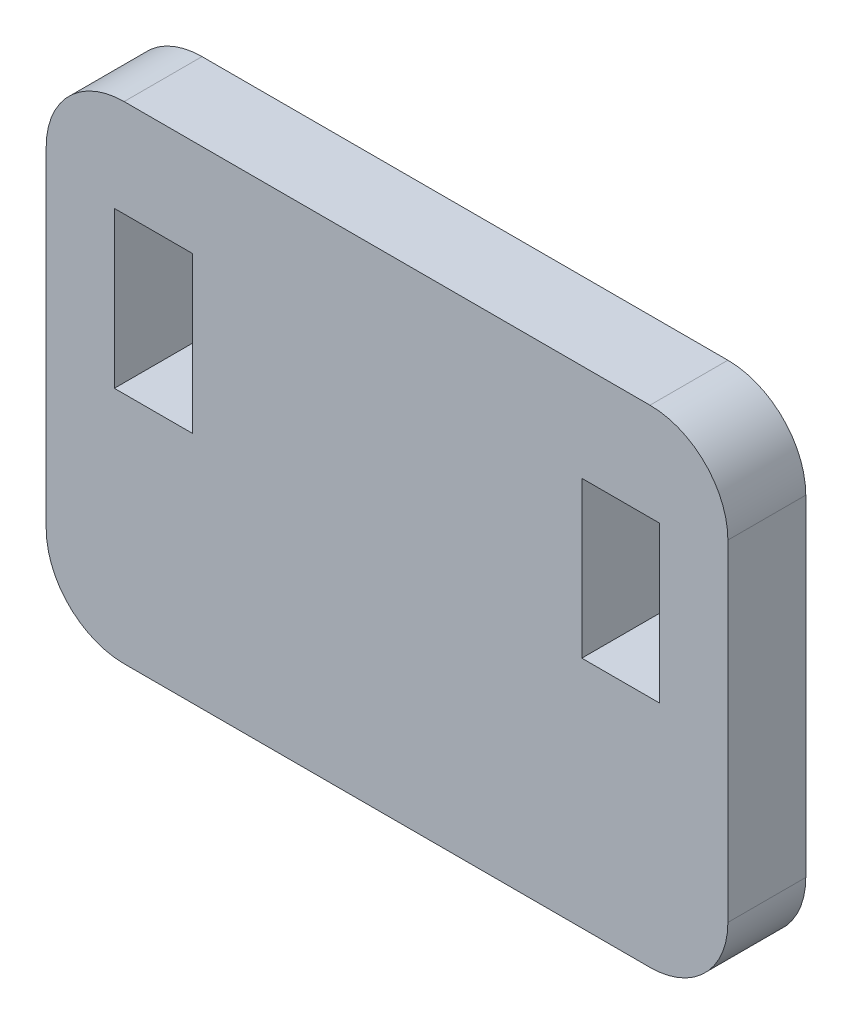
ISO-10303-21;
HEADER;
FILE_DESCRIPTION(('STEP AP214'),'2;1');
FILE_NAME('part.step','',(''),(''),'','','');
FILE_SCHEMA(('AUTOMOTIVE_DESIGN { 1 0 10303 214 1 1 1 1 }'));
ENDSEC;
DATA;
#1=APPLICATION_CONTEXT('core data for automotive mechanical design processes');
#2=APPLICATION_PROTOCOL_DEFINITION('international standard','automotive_design',2000,#1);
#3=PRODUCT_CONTEXT('',#1,'mechanical');
#4=PRODUCT('Part','Part','',(#3));
#5=PRODUCT_RELATED_PRODUCT_CATEGORY('part','',(#4));
#6=PRODUCT_DEFINITION_FORMATION('','',#4);
#7=PRODUCT_DEFINITION_CONTEXT('part definition',#1,'design');
#8=PRODUCT_DEFINITION('design','',#6,#7);
#9=PRODUCT_DEFINITION_SHAPE('','',#8);
#10=(LENGTH_UNIT() NAMED_UNIT(*) SI_UNIT(.MILLI.,.METRE.));
#11=(NAMED_UNIT(*) PLANE_ANGLE_UNIT() SI_UNIT($,.RADIAN.));
#12=(NAMED_UNIT(*) SI_UNIT($,.STERADIAN.) SOLID_ANGLE_UNIT());
#13=UNCERTAINTY_MEASURE_WITH_UNIT(LENGTH_MEASURE(1.E-05),#10,'distance_accuracy_value','');
#14=(GEOMETRIC_REPRESENTATION_CONTEXT(3) GLOBAL_UNCERTAINTY_ASSIGNED_CONTEXT((#13)) GLOBAL_UNIT_ASSIGNED_CONTEXT((#10,
#11,#12)) REPRESENTATION_CONTEXT('',''));
#15=CARTESIAN_POINT('',(0.,0.,0.));
#16=DIRECTION('',(0.,0.,1.));
#17=DIRECTION('',(1.,0.,0.));
#18=AXIS2_PLACEMENT_3D('',#15,#16,#17);
#19=CARTESIAN_POINT('',(31.,4.,4.));
#20=DIRECTION('',(0.,0.,1.));
#21=DIRECTION('',(1.,0.,0.));
#22=AXIS2_PLACEMENT_3D('',#19,#20,#21);
#23=PLANE('',#22);
#24=CARTESIAN_POINT('',(31.,4.,4.));
#25=DIRECTION('',(0.,0.,1.));
#26=DIRECTION('',(1.,0.,0.));
#27=AXIS2_PLACEMENT_3D('',#24,#25,#26);
#28=CIRCLE('',#27,4.);
#29=CARTESIAN_POINT('',(31.,0.,4.));
#30=VERTEX_POINT('',#29);
#31=CARTESIAN_POINT('',(35.,4.00000000000003,4.));
#32=VERTEX_POINT('',#31);
#33=EDGE_CURVE('E244',#30,#32,#28,.T.);
#34=ORIENTED_EDGE('',*,*,#33,.T.);
#35=DIRECTION('',(0.,1.,0.));
#36=VECTOR('',#35,1.);
#37=CARTESIAN_POINT('',(35.,4.00000000000003,4.));
#38=LINE('',#37,#36);
#39=CARTESIAN_POINT('',(35.,21.,4.));
#40=VERTEX_POINT('',#39);
#41=EDGE_CURVE('E248',#32,#40,#38,.T.);
#42=ORIENTED_EDGE('',*,*,#41,.T.);
#43=CARTESIAN_POINT('',(31.,21.,4.));
#44=DIRECTION('',(0.,0.,1.));
#45=DIRECTION('',(-1.,0.,0.));
#46=AXIS2_PLACEMENT_3D('',#43,#44,#45);
#47=CIRCLE('',#46,4.);
#48=CARTESIAN_POINT('',(31.,25.,4.));
#49=VERTEX_POINT('',#48);
#50=EDGE_CURVE('E252',#40,#49,#47,.T.);
#51=ORIENTED_EDGE('',*,*,#50,.T.);
#52=DIRECTION('',(-1.,0.,0.));
#53=VECTOR('',#52,1.);
#54=CARTESIAN_POINT('',(4.,25.,4.));
#55=LINE('',#54,#53);
#56=CARTESIAN_POINT('',(4.,25.,4.));
#57=VERTEX_POINT('',#56);
#58=EDGE_CURVE('E255',#49,#57,#55,.T.);
#59=ORIENTED_EDGE('',*,*,#58,.T.);
#60=CARTESIAN_POINT('',(4.,21.,4.));
#61=DIRECTION('',(0.,0.,1.));
#62=DIRECTION('',(-1.,0.,0.));
#63=AXIS2_PLACEMENT_3D('',#60,#61,#62);
#64=CIRCLE('',#63,4.);
#65=CARTESIAN_POINT('',(0.,21.,4.));
#66=VERTEX_POINT('',#65);
#67=EDGE_CURVE('E258',#57,#66,#64,.T.);
#68=ORIENTED_EDGE('',*,*,#67,.T.);
#69=DIRECTION('',(0.,-1.,0.));
#70=VECTOR('',#69,1.);
#71=CARTESIAN_POINT('',(0.,4.00000000000003,4.));
#72=LINE('',#71,#70);
#73=CARTESIAN_POINT('',(0.,4.,4.));
#74=VERTEX_POINT('',#73);
#75=EDGE_CURVE('E261',#66,#74,#72,.T.);
#76=ORIENTED_EDGE('',*,*,#75,.T.);
#77=CARTESIAN_POINT('',(4.,4.,4.));
#78=DIRECTION('',(0.,0.,1.));
#79=DIRECTION('',(-1.,0.,0.));
#80=AXIS2_PLACEMENT_3D('',#77,#78,#79);
#81=CIRCLE('',#80,4.);
#82=CARTESIAN_POINT('',(4.00000000000003,0.,4.));
#83=VERTEX_POINT('',#82);
#84=EDGE_CURVE('E264',#74,#83,#81,.T.);
#85=ORIENTED_EDGE('',*,*,#84,.T.);
#86=DIRECTION('',(1.,0.,0.));
#87=VECTOR('',#86,1.);
#88=CARTESIAN_POINT('',(4.00000000000003,0.,4.));
#89=LINE('',#88,#87);
#90=EDGE_CURVE('E267',#83,#30,#89,.T.);
#91=ORIENTED_EDGE('',*,*,#90,.T.);
#92=EDGE_LOOP('',(#34,#42,#51,#59,#68,#76,#85,#91));
#93=FACE_BOUND('',#92,.T.);
#94=DIRECTION('',(1.,0.,0.));
#95=VECTOR('',#94,1.);
#96=CARTESIAN_POINT('',(3.5,12.,4.));
#97=LINE('',#96,#95);
#98=CARTESIAN_POINT('',(3.5,12.,4.));
#99=VERTEX_POINT('',#98);
#100=CARTESIAN_POINT('',(7.5,12.,4.));
#101=VERTEX_POINT('',#100);
#102=EDGE_CURVE('E204',#99,#101,#97,.T.);
#103=ORIENTED_EDGE('',*,*,#102,.F.);
#104=DIRECTION('',(0.,-1.,0.));
#105=VECTOR('',#104,1.);
#106=CARTESIAN_POINT('',(3.5,20.,4.));
#107=LINE('',#106,#105);
#108=CARTESIAN_POINT('',(3.5,20.,4.));
#109=VERTEX_POINT('',#108);
#110=EDGE_CURVE('E201',#109,#99,#107,.T.);
#111=ORIENTED_EDGE('',*,*,#110,.F.);
#112=DIRECTION('',(-1.,0.,0.));
#113=VECTOR('',#112,1.);
#114=CARTESIAN_POINT('',(3.5,20.,4.));
#115=LINE('',#114,#113);
#116=CARTESIAN_POINT('',(7.5,20.,4.));
#117=VERTEX_POINT('',#116);
#118=EDGE_CURVE('E212',#117,#109,#115,.T.);
#119=ORIENTED_EDGE('',*,*,#118,.F.);
#120=DIRECTION('',(0.,1.,0.));
#121=VECTOR('',#120,1.);
#122=CARTESIAN_POINT('',(7.5,20.,4.));
#123=LINE('',#122,#121);
#124=EDGE_CURVE('E208',#101,#117,#123,.T.);
#125=ORIENTED_EDGE('',*,*,#124,.F.);
#126=EDGE_LOOP('',(#103,#111,#119,#125));
#127=FACE_BOUND('',#126,.T.);
#128=DIRECTION('',(-1.,0.,0.));
#129=VECTOR('',#128,1.);
#130=CARTESIAN_POINT('',(31.5,20.,4.));
#131=LINE('',#130,#129);
#132=CARTESIAN_POINT('',(31.5,20.,4.));
#133=VERTEX_POINT('',#132);
#134=CARTESIAN_POINT('',(27.5,20.,4.));
#135=VERTEX_POINT('',#134);
#136=EDGE_CURVE('E162',#133,#135,#131,.T.);
#137=ORIENTED_EDGE('',*,*,#136,.F.);
#138=DIRECTION('',(0.,1.,0.));
#139=VECTOR('',#138,1.);
#140=CARTESIAN_POINT('',(31.5,20.,4.));
#141=LINE('',#140,#139);
#142=CARTESIAN_POINT('',(31.5,12.,4.));
#143=VERTEX_POINT('',#142);
#144=EDGE_CURVE('E153',#143,#133,#141,.T.);
#145=ORIENTED_EDGE('',*,*,#144,.F.);
#146=DIRECTION('',(1.,0.,0.));
#147=VECTOR('',#146,1.);
#148=CARTESIAN_POINT('',(31.5,12.,4.));
#149=LINE('',#148,#147);
#150=CARTESIAN_POINT('',(27.5,12.,4.));
#151=VERTEX_POINT('',#150);
#152=EDGE_CURVE('E179',#151,#143,#149,.T.);
#153=ORIENTED_EDGE('',*,*,#152,.F.);
#154=DIRECTION('',(0.,-1.,0.));
#155=VECTOR('',#154,1.);
#156=CARTESIAN_POINT('',(27.5,20.,4.));
#157=LINE('',#156,#155);
#158=EDGE_CURVE('E175',#135,#151,#157,.T.);
#159=ORIENTED_EDGE('',*,*,#158,.F.);
#160=EDGE_LOOP('',(#137,#145,#153,#159));
#161=FACE_BOUND('',#160,.T.);
#162=ADVANCED_FACE('F39',(#93,#127,#161),#23,.T.);
#163=CARTESIAN_POINT('',(31.,4.,0.));
#164=DIRECTION('',(0.,0.,1.));
#165=DIRECTION('',(1.,0.,0.));
#166=AXIS2_PLACEMENT_3D('',#163,#164,#165);
#167=PLANE('',#166);
#168=DIRECTION('',(0.,-1.,0.));
#169=VECTOR('',#168,1.);
#170=CARTESIAN_POINT('',(3.5,20.,0.));
#171=LINE('',#170,#169);
#172=CARTESIAN_POINT('',(3.5,20.,0.));
#173=VERTEX_POINT('',#172);
#174=CARTESIAN_POINT('',(3.5,12.,0.));
#175=VERTEX_POINT('',#174);
#176=EDGE_CURVE('E171',#173,#175,#171,.T.);
#177=ORIENTED_EDGE('',*,*,#176,.T.);
#178=DIRECTION('',(1.,0.,0.));
#179=VECTOR('',#178,1.);
#180=CARTESIAN_POINT('',(3.5,12.,0.));
#181=LINE('',#180,#179);
#182=CARTESIAN_POINT('',(7.5,12.,0.));
#183=VERTEX_POINT('',#182);
#184=EDGE_CURVE('E219',#175,#183,#181,.T.);
#185=ORIENTED_EDGE('',*,*,#184,.T.);
#186=DIRECTION('',(0.,1.,0.));
#187=VECTOR('',#186,1.);
#188=CARTESIAN_POINT('',(7.5,20.,0.));
#189=LINE('',#188,#187);
#190=CARTESIAN_POINT('',(7.5,20.,0.));
#191=VERTEX_POINT('',#190);
#192=EDGE_CURVE('E223',#183,#191,#189,.T.);
#193=ORIENTED_EDGE('',*,*,#192,.T.);
#194=DIRECTION('',(-1.,0.,0.));
#195=VECTOR('',#194,1.);
#196=CARTESIAN_POINT('',(3.5,20.,0.));
#197=LINE('',#196,#195);
#198=EDGE_CURVE('E205',#191,#173,#197,.T.);
#199=ORIENTED_EDGE('',*,*,#198,.T.);
#200=EDGE_LOOP('',(#177,#185,#193,#199));
#201=FACE_BOUND('',#200,.T.);
#202=CARTESIAN_POINT('',(31.,4.,0.));
#203=DIRECTION('',(0.,0.,1.));
#204=DIRECTION('',(1.,0.,0.));
#205=AXIS2_PLACEMENT_3D('',#202,#203,#204);
#206=CIRCLE('',#205,4.);
#207=CARTESIAN_POINT('',(31.,0.,0.));
#208=VERTEX_POINT('',#207);
#209=CARTESIAN_POINT('',(35.,4.00000000000003,0.));
#210=VERTEX_POINT('',#209);
#211=EDGE_CURVE('E243',#208,#210,#206,.T.);
#212=ORIENTED_EDGE('',*,*,#211,.F.);
#213=DIRECTION('',(1.,0.,0.));
#214=VECTOR('',#213,1.);
#215=CARTESIAN_POINT('',(4.00000000000003,0.,0.));
#216=LINE('',#215,#214);
#217=CARTESIAN_POINT('',(4.00000000000003,0.,0.));
#218=VERTEX_POINT('',#217);
#219=EDGE_CURVE('E249',#218,#208,#216,.T.);
#220=ORIENTED_EDGE('',*,*,#219,.F.);
#221=CARTESIAN_POINT('',(4.,4.,0.));
#222=DIRECTION('',(0.,0.,1.));
#223=DIRECTION('',(-1.,0.,0.));
#224=AXIS2_PLACEMENT_3D('',#221,#222,#223);
#225=CIRCLE('',#224,4.);
#226=CARTESIAN_POINT('',(0.,4.,0.));
#227=VERTEX_POINT('',#226);
#228=EDGE_CURVE('E289',#227,#218,#225,.T.);
#229=ORIENTED_EDGE('',*,*,#228,.F.);
#230=DIRECTION('',(0.,-1.,0.));
#231=VECTOR('',#230,1.);
#232=CARTESIAN_POINT('',(0.,4.00000000000003,0.));
#233=LINE('',#232,#231);
#234=CARTESIAN_POINT('',(0.,21.,0.));
#235=VERTEX_POINT('',#234);
#236=EDGE_CURVE('E286',#235,#227,#233,.T.);
#237=ORIENTED_EDGE('',*,*,#236,.F.);
#238=CARTESIAN_POINT('',(4.,21.,0.));
#239=DIRECTION('',(0.,0.,1.));
#240=DIRECTION('',(-1.,0.,0.));
#241=AXIS2_PLACEMENT_3D('',#238,#239,#240);
#242=CIRCLE('',#241,4.);
#243=CARTESIAN_POINT('',(4.,25.,0.));
#244=VERTEX_POINT('',#243);
#245=EDGE_CURVE('E283',#244,#235,#242,.T.);
#246=ORIENTED_EDGE('',*,*,#245,.F.);
#247=DIRECTION('',(-1.,0.,0.));
#248=VECTOR('',#247,1.);
#249=CARTESIAN_POINT('',(4.,25.,0.));
#250=LINE('',#249,#248);
#251=CARTESIAN_POINT('',(31.,25.,0.));
#252=VERTEX_POINT('',#251);
#253=EDGE_CURVE('E280',#252,#244,#250,.T.);
#254=ORIENTED_EDGE('',*,*,#253,.F.);
#255=CARTESIAN_POINT('',(31.,21.,0.));
#256=DIRECTION('',(0.,0.,1.));
#257=DIRECTION('',(-1.,0.,0.));
#258=AXIS2_PLACEMENT_3D('',#255,#256,#257);
#259=CIRCLE('',#258,4.);
#260=CARTESIAN_POINT('',(35.,21.,0.));
#261=VERTEX_POINT('',#260);
#262=EDGE_CURVE('E277',#261,#252,#259,.T.);
#263=ORIENTED_EDGE('',*,*,#262,.F.);
#264=DIRECTION('',(0.,1.,0.));
#265=VECTOR('',#264,1.);
#266=CARTESIAN_POINT('',(35.,4.00000000000003,0.));
#267=LINE('',#266,#265);
#268=EDGE_CURVE('E274',#210,#261,#267,.T.);
#269=ORIENTED_EDGE('',*,*,#268,.F.);
#270=EDGE_LOOP('',(#212,#220,#229,#237,#246,#254,#263,#269));
#271=FACE_BOUND('',#270,.T.);
#272=DIRECTION('',(0.,1.,0.));
#273=VECTOR('',#272,1.);
#274=CARTESIAN_POINT('',(31.5,20.,0.));
#275=LINE('',#274,#273);
#276=CARTESIAN_POINT('',(31.5,12.,0.));
#277=VERTEX_POINT('',#276);
#278=CARTESIAN_POINT('',(31.5,20.,0.));
#279=VERTEX_POINT('',#278);
#280=EDGE_CURVE('E63',#277,#279,#275,.T.);
#281=ORIENTED_EDGE('',*,*,#280,.T.);
#282=DIRECTION('',(-1.,0.,0.));
#283=VECTOR('',#282,1.);
#284=CARTESIAN_POINT('',(31.5,20.,0.));
#285=LINE('',#284,#283);
#286=CARTESIAN_POINT('',(27.5,20.,0.));
#287=VERTEX_POINT('',#286);
#288=EDGE_CURVE('E169',#279,#287,#285,.T.);
#289=ORIENTED_EDGE('',*,*,#288,.T.);
#290=DIRECTION('',(0.,-1.,0.));
#291=VECTOR('',#290,1.);
#292=CARTESIAN_POINT('',(27.5,20.,0.));
#293=LINE('',#292,#291);
#294=CARTESIAN_POINT('',(27.5,12.,0.));
#295=VERTEX_POINT('',#294);
#296=EDGE_CURVE('E188',#287,#295,#293,.T.);
#297=ORIENTED_EDGE('',*,*,#296,.T.);
#298=DIRECTION('',(1.,0.,0.));
#299=VECTOR('',#298,1.);
#300=CARTESIAN_POINT('',(31.5,12.,0.));
#301=LINE('',#300,#299);
#302=EDGE_CURVE('E163',#295,#277,#301,.T.);
#303=ORIENTED_EDGE('',*,*,#302,.T.);
#304=EDGE_LOOP('',(#281,#289,#297,#303));
#305=FACE_BOUND('',#304,.T.);
#306=ADVANCED_FACE('F328',(#201,#271,#305),#167,.F.);
#307=CARTESIAN_POINT('',(31.,4.,4.));
#308=DIRECTION('',(0.,0.,-1.));
#309=DIRECTION('',(-1.,0.,0.));
#310=AXIS2_PLACEMENT_3D('',#307,#308,#309);
#311=CYLINDRICAL_SURFACE('',#310,4.);
#312=ORIENTED_EDGE('',*,*,#211,.T.);
#313=DIRECTION('',(0.,0.,-1.));
#314=VECTOR('',#313,1.);
#315=CARTESIAN_POINT('',(35.,4.00000000000003,4.));
#316=LINE('',#315,#314);
#317=EDGE_CURVE('E11',#32,#210,#316,.T.);
#318=ORIENTED_EDGE('',*,*,#317,.F.);
#319=ORIENTED_EDGE('',*,*,#33,.F.);
#320=DIRECTION('',(0.,0.,-1.));
#321=VECTOR('',#320,1.);
#322=CARTESIAN_POINT('',(31.,0.,4.));
#323=LINE('',#322,#321);
#324=EDGE_CURVE('E270',#30,#208,#323,.T.);
#325=ORIENTED_EDGE('',*,*,#324,.T.);
#326=EDGE_LOOP('',(#312,#318,#319,#325));
#327=FACE_BOUND('',#326,.T.);
#328=ADVANCED_FACE('F41',(#327),#311,.T.);
#329=CARTESIAN_POINT('',(35.,4.00000000000003,4.));
#330=DIRECTION('',(-1.,0.,0.));
#331=DIRECTION('',(0.,0.,1.));
#332=AXIS2_PLACEMENT_3D('',#329,#330,#331);
#333=PLANE('',#332);
#334=ORIENTED_EDGE('',*,*,#268,.T.);
#335=DIRECTION('',(0.,0.,-1.));
#336=VECTOR('',#335,1.);
#337=CARTESIAN_POINT('',(35.,21.,4.));
#338=LINE('',#337,#336);
#339=EDGE_CURVE('E48',#40,#261,#338,.T.);
#340=ORIENTED_EDGE('',*,*,#339,.F.);
#341=ORIENTED_EDGE('',*,*,#41,.F.);
#342=ORIENTED_EDGE('',*,*,#317,.T.);
#343=EDGE_LOOP('',(#334,#340,#341,#342));
#344=FACE_BOUND('',#343,.T.);
#345=ADVANCED_FACE('F346',(#344),#333,.F.);
#346=CARTESIAN_POINT('',(31.,21.,4.));
#347=DIRECTION('',(0.,0.,-1.));
#348=DIRECTION('',(-1.,0.,0.));
#349=AXIS2_PLACEMENT_3D('',#346,#347,#348);
#350=CYLINDRICAL_SURFACE('',#349,4.);
#351=ORIENTED_EDGE('',*,*,#262,.T.);
#352=DIRECTION('',(0.,0.,-1.));
#353=VECTOR('',#352,1.);
#354=CARTESIAN_POINT('',(31.,25.,4.));
#355=LINE('',#354,#353);
#356=EDGE_CURVE('E313',#49,#252,#355,.T.);
#357=ORIENTED_EDGE('',*,*,#356,.F.);
#358=ORIENTED_EDGE('',*,*,#50,.F.);
#359=ORIENTED_EDGE('',*,*,#339,.T.);
#360=EDGE_LOOP('',(#351,#357,#358,#359));
#361=FACE_BOUND('',#360,.T.);
#362=ADVANCED_FACE('F322',(#361),#350,.T.);
#363=CARTESIAN_POINT('',(4.,25.,4.));
#364=DIRECTION('',(0.,-1.,0.));
#365=DIRECTION('',(1.,0.,0.));
#366=AXIS2_PLACEMENT_3D('',#363,#364,#365);
#367=PLANE('',#366);
#368=ORIENTED_EDGE('',*,*,#253,.T.);
#369=DIRECTION('',(0.,0.,-1.));
#370=VECTOR('',#369,1.);
#371=CARTESIAN_POINT('',(4.,25.,4.));
#372=LINE('',#371,#370);
#373=EDGE_CURVE('E309',#57,#244,#372,.T.);
#374=ORIENTED_EDGE('',*,*,#373,.F.);
#375=ORIENTED_EDGE('',*,*,#58,.F.);
#376=ORIENTED_EDGE('',*,*,#356,.T.);
#377=EDGE_LOOP('',(#368,#374,#375,#376));
#378=FACE_BOUND('',#377,.T.);
#379=ADVANCED_FACE('F334',(#378),#367,.F.);
#380=CARTESIAN_POINT('',(4.,21.,4.));
#381=DIRECTION('',(0.,0.,-1.));
#382=DIRECTION('',(-1.,0.,0.));
#383=AXIS2_PLACEMENT_3D('',#380,#381,#382);
#384=CYLINDRICAL_SURFACE('',#383,4.);
#385=ORIENTED_EDGE('',*,*,#245,.T.);
#386=DIRECTION('',(0.,0.,-1.));
#387=VECTOR('',#386,1.);
#388=CARTESIAN_POINT('',(0.,21.,4.));
#389=LINE('',#388,#387);
#390=EDGE_CURVE('E305',#66,#235,#389,.T.);
#391=ORIENTED_EDGE('',*,*,#390,.F.);
#392=ORIENTED_EDGE('',*,*,#67,.F.);
#393=ORIENTED_EDGE('',*,*,#373,.T.);
#394=EDGE_LOOP('',(#385,#391,#392,#393));
#395=FACE_BOUND('',#394,.T.);
#396=ADVANCED_FACE('F338',(#395),#384,.T.);
#397=CARTESIAN_POINT('',(0.,4.00000000000003,4.));
#398=DIRECTION('',(1.,0.,0.));
#399=DIRECTION('',(0.,0.,-1.));
#400=AXIS2_PLACEMENT_3D('',#397,#398,#399);
#401=PLANE('',#400);
#402=ORIENTED_EDGE('',*,*,#236,.T.);
#403=DIRECTION('',(0.,0.,-1.));
#404=VECTOR('',#403,1.);
#405=CARTESIAN_POINT('',(0.,4.,4.));
#406=LINE('',#405,#404);
#407=EDGE_CURVE('E301',#74,#227,#406,.T.);
#408=ORIENTED_EDGE('',*,*,#407,.F.);
#409=ORIENTED_EDGE('',*,*,#75,.F.);
#410=ORIENTED_EDGE('',*,*,#390,.T.);
#411=EDGE_LOOP('',(#402,#408,#409,#410));
#412=FACE_BOUND('',#411,.T.);
#413=ADVANCED_FACE('F359',(#412),#401,.F.);
#414=CARTESIAN_POINT('',(4.,4.,4.));
#415=DIRECTION('',(0.,0.,-1.));
#416=DIRECTION('',(-1.,0.,0.));
#417=AXIS2_PLACEMENT_3D('',#414,#415,#416);
#418=CYLINDRICAL_SURFACE('',#417,4.);
#419=ORIENTED_EDGE('',*,*,#228,.T.);
#420=DIRECTION('',(0.,0.,-1.));
#421=VECTOR('',#420,1.);
#422=CARTESIAN_POINT('',(4.00000000000003,0.,4.));
#423=LINE('',#422,#421);
#424=EDGE_CURVE('E297',#83,#218,#423,.T.);
#425=ORIENTED_EDGE('',*,*,#424,.F.);
#426=ORIENTED_EDGE('',*,*,#84,.F.);
#427=ORIENTED_EDGE('',*,*,#407,.T.);
#428=EDGE_LOOP('',(#419,#425,#426,#427));
#429=FACE_BOUND('',#428,.T.);
#430=ADVANCED_FACE('F357',(#429),#418,.T.);
#431=CARTESIAN_POINT('',(4.00000000000003,0.,4.));
#432=DIRECTION('',(0.,1.,0.));
#433=DIRECTION('',(0.,0.,1.));
#434=AXIS2_PLACEMENT_3D('',#431,#432,#433);
#435=PLANE('',#434);
#436=ORIENTED_EDGE('',*,*,#219,.T.);
#437=ORIENTED_EDGE('',*,*,#324,.F.);
#438=ORIENTED_EDGE('',*,*,#90,.F.);
#439=ORIENTED_EDGE('',*,*,#424,.T.);
#440=EDGE_LOOP('',(#436,#437,#438,#439));
#441=FACE_BOUND('',#440,.T.);
#442=ADVANCED_FACE('F352',(#441),#435,.F.);
#443=CARTESIAN_POINT('',(3.5,20.,4.));
#444=DIRECTION('',(1.,0.,0.));
#445=DIRECTION('',(0.,1.,0.));
#446=AXIS2_PLACEMENT_3D('',#443,#444,#445);
#447=PLANE('',#446);
#448=ORIENTED_EDGE('',*,*,#176,.F.);
#449=DIRECTION('',(0.,0.,-1.));
#450=VECTOR('',#449,1.);
#451=CARTESIAN_POINT('',(3.5,20.,4.));
#452=LINE('',#451,#450);
#453=EDGE_CURVE('E215',#109,#173,#452,.T.);
#454=ORIENTED_EDGE('',*,*,#453,.F.);
#455=ORIENTED_EDGE('',*,*,#110,.T.);
#456=DIRECTION('',(0.,0.,-1.));
#457=VECTOR('',#456,1.);
#458=CARTESIAN_POINT('',(3.5,12.,4.));
#459=LINE('',#458,#457);
#460=EDGE_CURVE('E239',#99,#175,#459,.T.);
#461=ORIENTED_EDGE('',*,*,#460,.T.);
#462=EDGE_LOOP('',(#448,#454,#455,#461));
#463=FACE_BOUND('',#462,.T.);
#464=ADVANCED_FACE('F376',(#463),#447,.T.);
#465=CARTESIAN_POINT('',(3.5,12.,4.));
#466=DIRECTION('',(0.,1.,0.));
#467=DIRECTION('',(0.,0.,1.));
#468=AXIS2_PLACEMENT_3D('',#465,#466,#467);
#469=PLANE('',#468);
#470=ORIENTED_EDGE('',*,*,#184,.F.);
#471=ORIENTED_EDGE('',*,*,#460,.F.);
#472=ORIENTED_EDGE('',*,*,#102,.T.);
#473=DIRECTION('',(0.,0.,-1.));
#474=VECTOR('',#473,1.);
#475=CARTESIAN_POINT('',(7.5,12.,4.));
#476=LINE('',#475,#474);
#477=EDGE_CURVE('E236',#101,#183,#476,.T.);
#478=ORIENTED_EDGE('',*,*,#477,.T.);
#479=EDGE_LOOP('',(#470,#471,#472,#478));
#480=FACE_BOUND('',#479,.T.);
#481=ADVANCED_FACE('F383',(#480),#469,.T.);
#482=CARTESIAN_POINT('',(7.5,20.,4.));
#483=DIRECTION('',(-1.,0.,0.));
#484=DIRECTION('',(0.,0.,1.));
#485=AXIS2_PLACEMENT_3D('',#482,#483,#484);
#486=PLANE('',#485);
#487=ORIENTED_EDGE('',*,*,#192,.F.);
#488=ORIENTED_EDGE('',*,*,#477,.F.);
#489=ORIENTED_EDGE('',*,*,#124,.T.);
#490=DIRECTION('',(0.,0.,-1.));
#491=VECTOR('',#490,1.);
#492=CARTESIAN_POINT('',(7.5,20.,4.));
#493=LINE('',#492,#491);
#494=EDGE_CURVE('E233',#117,#191,#493,.T.);
#495=ORIENTED_EDGE('',*,*,#494,.T.);
#496=EDGE_LOOP('',(#487,#488,#489,#495));
#497=FACE_BOUND('',#496,.T.);
#498=ADVANCED_FACE('F388',(#497),#486,.T.);
#499=CARTESIAN_POINT('',(3.5,20.,4.));
#500=DIRECTION('',(0.,-1.,0.));
#501=DIRECTION('',(0.,0.,-1.));
#502=AXIS2_PLACEMENT_3D('',#499,#500,#501);
#503=PLANE('',#502);
#504=ORIENTED_EDGE('',*,*,#198,.F.);
#505=ORIENTED_EDGE('',*,*,#494,.F.);
#506=ORIENTED_EDGE('',*,*,#118,.T.);
#507=ORIENTED_EDGE('',*,*,#453,.T.);
#508=EDGE_LOOP('',(#504,#505,#506,#507));
#509=FACE_BOUND('',#508,.T.);
#510=ADVANCED_FACE('F395',(#509),#503,.T.);
#511=CARTESIAN_POINT('',(31.5,20.,4.));
#512=DIRECTION('',(-1.,0.,0.));
#513=DIRECTION('',(0.,-1.,0.));
#514=AXIS2_PLACEMENT_3D('',#511,#512,#513);
#515=PLANE('',#514);
#516=ORIENTED_EDGE('',*,*,#280,.F.);
#517=DIRECTION('',(0.,0.,-1.));
#518=VECTOR('',#517,1.);
#519=CARTESIAN_POINT('',(31.5,12.,4.));
#520=LINE('',#519,#518);
#521=EDGE_CURVE('E157',#143,#277,#520,.T.);
#522=ORIENTED_EDGE('',*,*,#521,.F.);
#523=ORIENTED_EDGE('',*,*,#144,.T.);
#524=DIRECTION('',(0.,0.,-1.));
#525=VECTOR('',#524,1.);
#526=CARTESIAN_POINT('',(31.5,20.,4.));
#527=LINE('',#526,#525);
#528=EDGE_CURVE('E156',#133,#279,#527,.T.);
#529=ORIENTED_EDGE('',*,*,#528,.T.);
#530=EDGE_LOOP('',(#516,#522,#523,#529));
#531=FACE_BOUND('',#530,.T.);
#532=ADVANCED_FACE('F155',(#531),#515,.T.);
#533=CARTESIAN_POINT('',(31.5,20.,4.));
#534=DIRECTION('',(0.,-1.,0.));
#535=DIRECTION('',(0.,0.,-1.));
#536=AXIS2_PLACEMENT_3D('',#533,#534,#535);
#537=PLANE('',#536);
#538=ORIENTED_EDGE('',*,*,#288,.F.);
#539=ORIENTED_EDGE('',*,*,#528,.F.);
#540=ORIENTED_EDGE('',*,*,#136,.T.);
#541=DIRECTION('',(0.,0.,-1.));
#542=VECTOR('',#541,1.);
#543=CARTESIAN_POINT('',(27.5,20.,4.));
#544=LINE('',#543,#542);
#545=EDGE_CURVE('E172',#135,#287,#544,.T.);
#546=ORIENTED_EDGE('',*,*,#545,.T.);
#547=EDGE_LOOP('',(#538,#539,#540,#546));
#548=FACE_BOUND('',#547,.T.);
#549=ADVANCED_FACE('F166',(#548),#537,.T.);
#550=CARTESIAN_POINT('',(27.5,20.,4.));
#551=DIRECTION('',(1.,0.,0.));
#552=DIRECTION('',(0.,0.,-1.));
#553=AXIS2_PLACEMENT_3D('',#550,#551,#552);
#554=PLANE('',#553);
#555=ORIENTED_EDGE('',*,*,#296,.F.);
#556=ORIENTED_EDGE('',*,*,#545,.F.);
#557=ORIENTED_EDGE('',*,*,#158,.T.);
#558=DIRECTION('',(0.,0.,-1.));
#559=VECTOR('',#558,1.);
#560=CARTESIAN_POINT('',(27.5,12.,4.));
#561=LINE('',#560,#559);
#562=EDGE_CURVE('E55',#151,#295,#561,.T.);
#563=ORIENTED_EDGE('',*,*,#562,.T.);
#564=EDGE_LOOP('',(#555,#556,#557,#563));
#565=FACE_BOUND('',#564,.T.);
#566=ADVANCED_FACE('F413',(#565),#554,.T.);
#567=CARTESIAN_POINT('',(31.5,12.,4.));
#568=DIRECTION('',(0.,1.,0.));
#569=DIRECTION('',(-1.,0.,0.));
#570=AXIS2_PLACEMENT_3D('',#567,#568,#569);
#571=PLANE('',#570);
#572=ORIENTED_EDGE('',*,*,#302,.F.);
#573=ORIENTED_EDGE('',*,*,#562,.F.);
#574=ORIENTED_EDGE('',*,*,#152,.T.);
#575=ORIENTED_EDGE('',*,*,#521,.T.);
#576=EDGE_LOOP('',(#572,#573,#574,#575));
#577=FACE_BOUND('',#576,.T.);
#578=ADVANCED_FACE('F416',(#577),#571,.T.);
#579=CLOSED_SHELL('',(#162,#306,#328,#345,#362,#379,#396,#413,#430,#442,#464,#481,#498,#510,
#532,#549,#566,#578));
#580=MANIFOLD_SOLID_BREP('B2',#579);
#581=ADVANCED_BREP_SHAPE_REPRESENTATION('',(#18,#580),#14);
#582=SHAPE_DEFINITION_REPRESENTATION(#9,#581);
ENDSEC;
END-ISO-10303-21;
